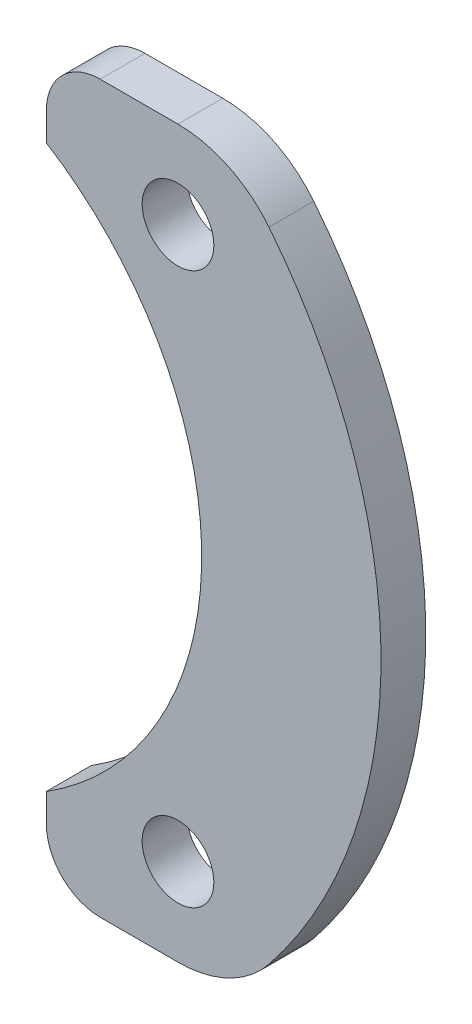
ISO-10303-21;
HEADER;
FILE_DESCRIPTION(('STEP AP214'),'2;1');
FILE_NAME('part.step','',(''),(''),'','','');
FILE_SCHEMA(('AUTOMOTIVE_DESIGN { 1 0 10303 214 1 1 1 1 }'));
ENDSEC;
DATA;
#1=APPLICATION_CONTEXT('core data for automotive mechanical design processes');
#2=APPLICATION_PROTOCOL_DEFINITION('international standard','automotive_design',2000,#1);
#3=PRODUCT_CONTEXT('',#1,'mechanical');
#4=PRODUCT('Part','Part','',(#3));
#5=PRODUCT_RELATED_PRODUCT_CATEGORY('part','',(#4));
#6=PRODUCT_DEFINITION_FORMATION('','',#4);
#7=PRODUCT_DEFINITION_CONTEXT('part definition',#1,'design');
#8=PRODUCT_DEFINITION('design','',#6,#7);
#9=PRODUCT_DEFINITION_SHAPE('','',#8);
#10=(LENGTH_UNIT() NAMED_UNIT(*) SI_UNIT(.MILLI.,.METRE.));
#11=(NAMED_UNIT(*) PLANE_ANGLE_UNIT() SI_UNIT($,.RADIAN.));
#12=(NAMED_UNIT(*) SI_UNIT($,.STERADIAN.) SOLID_ANGLE_UNIT());
#13=UNCERTAINTY_MEASURE_WITH_UNIT(LENGTH_MEASURE(1.E-05),#10,'distance_accuracy_value','');
#14=(GEOMETRIC_REPRESENTATION_CONTEXT(3) GLOBAL_UNCERTAINTY_ASSIGNED_CONTEXT((#13)) GLOBAL_UNIT_ASSIGNED_CONTEXT((#10,
#11,#12)) REPRESENTATION_CONTEXT('',''));
#15=CARTESIAN_POINT('',(0.,0.,0.));
#16=DIRECTION('',(0.,0.,1.));
#17=DIRECTION('',(1.,0.,0.));
#18=AXIS2_PLACEMENT_3D('',#15,#16,#17);
#19=CARTESIAN_POINT('',(17.1778106322656,13.7500000000001,2.5));
#20=DIRECTION('',(0.,0.,1.));
#21=DIRECTION('',(1.,0.,0.));
#22=AXIS2_PLACEMENT_3D('',#19,#20,#21);
#23=PLANE('',#22);
#24=CARTESIAN_POINT('',(17.1778106322657,-15.3913592438737,2.5));
#25=DIRECTION('',(0.,0.,1.));
#26=DIRECTION('',(1.,0.,0.));
#27=AXIS2_PLACEMENT_3D('',#24,#25,#26);
#28=CIRCLE('',#27,1.99999999999998);
#29=CARTESIAN_POINT('',(19.1778106322656,-15.3913592438737,2.5));
#30=VERTEX_POINT('',#29);
#31=EDGE_CURVE('E154',#30,#30,#28,.T.);
#32=ORIENTED_EDGE('',*,*,#31,.F.);
#33=EDGE_LOOP('',(#32));
#34=FACE_BOUND('',#33,.T.);
#35=CARTESIAN_POINT('',(17.1778106322656,13.7500000000001,2.5));
#36=DIRECTION('',(0.,0.,1.));
#37=DIRECTION('',(1.,0.,0.));
#38=AXIS2_PLACEMENT_3D('',#35,#36,#37);
#39=CIRCLE('',#38,6.5);
#40=CARTESIAN_POINT('',(22.2523406851082,17.8119139260697,2.5));
#41=VERTEX_POINT('',#40);
#42=CARTESIAN_POINT('',(17.1778106322656,20.2500000000001,2.5));
#43=VERTEX_POINT('',#42);
#44=EDGE_CURVE('E169',#41,#43,#39,.T.);
#45=ORIENTED_EDGE('',*,*,#44,.T.);
#46=DIRECTION('',(-1.,0.,0.));
#47=VECTOR('',#46,1.);
#48=CARTESIAN_POINT('',(17.1778106322656,20.2500000000001,2.5));
#49=LINE('',#48,#47);
#50=CARTESIAN_POINT('',(12.8330627677105,20.2500000000001,2.5));
#51=VERTEX_POINT('',#50);
#52=EDGE_CURVE('E107',#43,#51,#49,.T.);
#53=ORIENTED_EDGE('',*,*,#52,.T.);
#54=CARTESIAN_POINT('',(12.8330627677105,17.2500000000001,2.5));
#55=DIRECTION('',(0.,0.,1.));
#56=DIRECTION('',(1.,0.,0.));
#57=AXIS2_PLACEMENT_3D('',#54,#55,#56);
#58=CIRCLE('',#57,3.);
#59=CARTESIAN_POINT('',(9.83306276771046,17.2500000000001,2.5));
#60=VERTEX_POINT('',#59);
#61=EDGE_CURVE('E190',#51,#60,#58,.T.);
#62=ORIENTED_EDGE('',*,*,#61,.T.);
#63=DIRECTION('',(0.,-1.,0.));
#64=VECTOR('',#63,1.);
#65=CARTESIAN_POINT('',(9.83306276771046,17.2500000000001,2.5));
#66=LINE('',#65,#64);
#67=CARTESIAN_POINT('',(9.83306276771046,15.6703821461465,2.5));
#68=VERTEX_POINT('',#67);
#69=EDGE_CURVE('E209',#60,#68,#66,.T.);
#70=ORIENTED_EDGE('',*,*,#69,.T.);
#71=CARTESIAN_POINT('',(0.,0.,2.5));
#72=DIRECTION('',(0.,0.,-1.));
#73=DIRECTION('',(1.,0.,0.));
#74=AXIS2_PLACEMENT_3D('',#71,#72,#73);
#75=CIRCLE('',#74,18.5);
#76=CARTESIAN_POINT('',(9.83306276771046,-15.6703821461465,2.5));
#77=VERTEX_POINT('',#76);
#78=EDGE_CURVE('E206',#68,#77,#75,.T.);
#79=ORIENTED_EDGE('',*,*,#78,.T.);
#80=DIRECTION('',(0.,-1.,0.));
#81=VECTOR('',#80,1.);
#82=CARTESIAN_POINT('',(9.83306276771046,-15.6703821461465,2.5));
#83=LINE('',#82,#81);
#84=CARTESIAN_POINT('',(9.83306276771046,-17.2500000000001,2.5));
#85=VERTEX_POINT('',#84);
#86=EDGE_CURVE('E208',#77,#85,#83,.T.);
#87=ORIENTED_EDGE('',*,*,#86,.T.);
#88=CARTESIAN_POINT('',(12.8330627677105,-17.2500000000001,2.5));
#89=DIRECTION('',(0.,0.,1.));
#90=DIRECTION('',(1.,0.,0.));
#91=AXIS2_PLACEMENT_3D('',#88,#89,#90);
#92=CIRCLE('',#91,3.);
#93=CARTESIAN_POINT('',(12.8330627677105,-20.2500000000001,2.5));
#94=VERTEX_POINT('',#93);
#95=EDGE_CURVE('E132',#85,#94,#92,.T.);
#96=ORIENTED_EDGE('',*,*,#95,.T.);
#97=DIRECTION('',(1.,0.,0.));
#98=VECTOR('',#97,1.);
#99=CARTESIAN_POINT('',(12.8330627677105,-20.2500000000001,2.5));
#100=LINE('',#99,#98);
#101=CARTESIAN_POINT('',(17.1778106322656,-20.2500000000001,2.5));
#102=VERTEX_POINT('',#101);
#103=EDGE_CURVE('E126',#94,#102,#100,.T.);
#104=ORIENTED_EDGE('',*,*,#103,.T.);
#105=CARTESIAN_POINT('',(17.1778106322656,-13.7500000000001,2.5));
#106=DIRECTION('',(0.,0.,1.));
#107=DIRECTION('',(1.,0.,0.));
#108=AXIS2_PLACEMENT_3D('',#105,#106,#107);
#109=CIRCLE('',#108,6.5);
#110=CARTESIAN_POINT('',(22.2523406851082,-17.8119139260697,2.5));
#111=VERTEX_POINT('',#110);
#112=EDGE_CURVE('E130',#102,#111,#109,.T.);
#113=ORIENTED_EDGE('',*,*,#112,.T.);
#114=CARTESIAN_POINT('',(0.,0.,2.5));
#115=DIRECTION('',(0.,0.,1.));
#116=DIRECTION('',(1.,0.,0.));
#117=AXIS2_PLACEMENT_3D('',#114,#115,#116);
#118=CIRCLE('',#117,28.5031742736811);
#119=EDGE_CURVE('E58',#111,#41,#118,.T.);
#120=ORIENTED_EDGE('',*,*,#119,.T.);
#121=EDGE_LOOP('',(#45,#53,#62,#70,#79,#87,#96,#104,#113,#120));
#122=FACE_BOUND('',#121,.T.);
#123=CARTESIAN_POINT('',(17.1778106322656,15.3913592438737,2.5));
#124=DIRECTION('',(0.,0.,1.));
#125=DIRECTION('',(1.,0.,0.));
#126=AXIS2_PLACEMENT_3D('',#123,#124,#125);
#127=CIRCLE('',#126,2.00000000000001);
#128=CARTESIAN_POINT('',(19.1778106322656,15.3913592438737,2.5));
#129=VERTEX_POINT('',#128);
#130=EDGE_CURVE('E220',#129,#129,#127,.T.);
#131=ORIENTED_EDGE('',*,*,#130,.F.);
#132=EDGE_LOOP('',(#131));
#133=FACE_BOUND('',#132,.T.);
#134=ADVANCED_FACE('F41',(#34,#122,#133),#23,.T.);
#135=CARTESIAN_POINT('',(17.1778106322656,13.7500000000001,0.));
#136=DIRECTION('',(0.,0.,1.));
#137=DIRECTION('',(1.,0.,0.));
#138=AXIS2_PLACEMENT_3D('',#135,#136,#137);
#139=PLANE('',#138);
#140=CARTESIAN_POINT('',(17.1778106322656,13.7500000000001,0.));
#141=DIRECTION('',(0.,0.,1.));
#142=DIRECTION('',(1.,0.,0.));
#143=AXIS2_PLACEMENT_3D('',#140,#141,#142);
#144=CIRCLE('',#143,6.5);
#145=CARTESIAN_POINT('',(22.2523406851082,17.8119139260697,0.));
#146=VERTEX_POINT('',#145);
#147=CARTESIAN_POINT('',(17.1778106322656,20.2500000000001,0.));
#148=VERTEX_POINT('',#147);
#149=EDGE_CURVE('E150',#146,#148,#144,.T.);
#150=ORIENTED_EDGE('',*,*,#149,.F.);
#151=CARTESIAN_POINT('',(0.,0.,0.));
#152=DIRECTION('',(0.,0.,1.));
#153=DIRECTION('',(1.,0.,0.));
#154=AXIS2_PLACEMENT_3D('',#151,#152,#153);
#155=CIRCLE('',#154,28.5031742736811);
#156=CARTESIAN_POINT('',(22.2523406851082,-17.8119139260697,0.));
#157=VERTEX_POINT('',#156);
#158=EDGE_CURVE('E99',#157,#146,#155,.T.);
#159=ORIENTED_EDGE('',*,*,#158,.F.);
#160=CARTESIAN_POINT('',(17.1778106322656,-13.7500000000001,0.));
#161=DIRECTION('',(0.,0.,1.));
#162=DIRECTION('',(1.,0.,0.));
#163=AXIS2_PLACEMENT_3D('',#160,#161,#162);
#164=CIRCLE('',#163,6.5);
#165=CARTESIAN_POINT('',(17.1778106322656,-20.2500000000001,0.));
#166=VERTEX_POINT('',#165);
#167=EDGE_CURVE('E93',#166,#157,#164,.T.);
#168=ORIENTED_EDGE('',*,*,#167,.F.);
#169=DIRECTION('',(1.,0.,0.));
#170=VECTOR('',#169,1.);
#171=CARTESIAN_POINT('',(12.8330627677105,-20.2500000000001,0.));
#172=LINE('',#171,#170);
#173=CARTESIAN_POINT('',(12.8330627677105,-20.2500000000001,0.));
#174=VERTEX_POINT('',#173);
#175=EDGE_CURVE('E140',#174,#166,#172,.T.);
#176=ORIENTED_EDGE('',*,*,#175,.F.);
#177=CARTESIAN_POINT('',(12.8330627677105,-17.2500000000001,0.));
#178=DIRECTION('',(0.,0.,1.));
#179=DIRECTION('',(1.,0.,0.));
#180=AXIS2_PLACEMENT_3D('',#177,#178,#179);
#181=CIRCLE('',#180,3.);
#182=CARTESIAN_POINT('',(9.83306276771046,-17.2500000000001,0.));
#183=VERTEX_POINT('',#182);
#184=EDGE_CURVE('E164',#183,#174,#181,.T.);
#185=ORIENTED_EDGE('',*,*,#184,.F.);
#186=DIRECTION('',(0.,-1.,0.));
#187=VECTOR('',#186,1.);
#188=CARTESIAN_POINT('',(9.83306276771046,-15.6703821461465,0.));
#189=LINE('',#188,#187);
#190=CARTESIAN_POINT('',(9.83306276771046,-15.6703821461465,0.));
#191=VERTEX_POINT('',#190);
#192=EDGE_CURVE('E162',#191,#183,#189,.T.);
#193=ORIENTED_EDGE('',*,*,#192,.F.);
#194=CARTESIAN_POINT('',(0.,0.,0.));
#195=DIRECTION('',(0.,0.,-1.));
#196=DIRECTION('',(1.,0.,0.));
#197=AXIS2_PLACEMENT_3D('',#194,#195,#196);
#198=CIRCLE('',#197,18.5);
#199=CARTESIAN_POINT('',(9.83306276771046,15.6703821461465,0.));
#200=VERTEX_POINT('',#199);
#201=EDGE_CURVE('E160',#200,#191,#198,.T.);
#202=ORIENTED_EDGE('',*,*,#201,.F.);
#203=DIRECTION('',(0.,-1.,0.));
#204=VECTOR('',#203,1.);
#205=CARTESIAN_POINT('',(9.83306276771046,17.2500000000001,0.));
#206=LINE('',#205,#204);
#207=CARTESIAN_POINT('',(9.83306276771046,17.2500000000001,0.));
#208=VERTEX_POINT('',#207);
#209=EDGE_CURVE('E158',#208,#200,#206,.T.);
#210=ORIENTED_EDGE('',*,*,#209,.F.);
#211=CARTESIAN_POINT('',(12.8330627677105,17.2500000000001,0.));
#212=DIRECTION('',(0.,0.,1.));
#213=DIRECTION('',(1.,0.,0.));
#214=AXIS2_PLACEMENT_3D('',#211,#212,#213);
#215=CIRCLE('',#214,3.);
#216=CARTESIAN_POINT('',(12.8330627677105,20.2500000000001,0.));
#217=VERTEX_POINT('',#216);
#218=EDGE_CURVE('E156',#217,#208,#215,.T.);
#219=ORIENTED_EDGE('',*,*,#218,.F.);
#220=DIRECTION('',(-1.,0.,0.));
#221=VECTOR('',#220,1.);
#222=CARTESIAN_POINT('',(17.1778106322656,20.2500000000001,0.));
#223=LINE('',#222,#221);
#224=EDGE_CURVE('E153',#148,#217,#223,.T.);
#225=ORIENTED_EDGE('',*,*,#224,.F.);
#226=EDGE_LOOP('',(#150,#159,#168,#176,#185,#193,#202,#210,#219,#225));
#227=FACE_BOUND('',#226,.T.);
#228=CARTESIAN_POINT('',(17.1778106322657,-15.3913592438737,0.));
#229=DIRECTION('',(0.,0.,1.));
#230=DIRECTION('',(1.,0.,0.));
#231=AXIS2_PLACEMENT_3D('',#228,#229,#230);
#232=CIRCLE('',#231,1.99999999999998);
#233=CARTESIAN_POINT('',(19.1778106322656,-15.3913592438737,0.));
#234=VERTEX_POINT('',#233);
#235=EDGE_CURVE('E217',#234,#234,#232,.T.);
#236=ORIENTED_EDGE('',*,*,#235,.T.);
#237=EDGE_LOOP('',(#236));
#238=FACE_BOUND('',#237,.T.);
#239=CARTESIAN_POINT('',(17.1778106322656,15.3913592438737,0.));
#240=DIRECTION('',(0.,0.,1.));
#241=DIRECTION('',(1.,0.,0.));
#242=AXIS2_PLACEMENT_3D('',#239,#240,#241);
#243=CIRCLE('',#242,2.00000000000001);
#244=CARTESIAN_POINT('',(19.1778106322656,15.3913592438737,0.));
#245=VERTEX_POINT('',#244);
#246=EDGE_CURVE('E223',#245,#245,#243,.T.);
#247=ORIENTED_EDGE('',*,*,#246,.T.);
#248=EDGE_LOOP('',(#247));
#249=FACE_BOUND('',#248,.T.);
#250=ADVANCED_FACE('F194',(#227,#238,#249),#139,.F.);
#251=CARTESIAN_POINT('',(17.1778106322656,13.7500000000001,2.5));
#252=DIRECTION('',(0.,0.,-1.));
#253=DIRECTION('',(-1.,0.,0.));
#254=AXIS2_PLACEMENT_3D('',#251,#252,#253);
#255=CYLINDRICAL_SURFACE('',#254,6.5);
#256=ORIENTED_EDGE('',*,*,#149,.T.);
#257=DIRECTION('',(0.,0.,-1.));
#258=VECTOR('',#257,1.);
#259=CARTESIAN_POINT('',(17.1778106322656,20.2500000000001,2.5));
#260=LINE('',#259,#258);
#261=EDGE_CURVE('E13',#43,#148,#260,.T.);
#262=ORIENTED_EDGE('',*,*,#261,.F.);
#263=ORIENTED_EDGE('',*,*,#44,.F.);
#264=DIRECTION('',(0.,0.,-1.));
#265=VECTOR('',#264,1.);
#266=CARTESIAN_POINT('',(22.2523406851082,17.8119139260697,2.5));
#267=LINE('',#266,#265);
#268=EDGE_CURVE('E146',#41,#146,#267,.T.);
#269=ORIENTED_EDGE('',*,*,#268,.T.);
#270=EDGE_LOOP('',(#256,#262,#263,#269));
#271=FACE_BOUND('',#270,.T.);
#272=ADVANCED_FACE('F43',(#271),#255,.T.);
#273=CARTESIAN_POINT('',(17.1778106322656,20.2500000000001,2.5));
#274=DIRECTION('',(0.,-1.,0.));
#275=DIRECTION('',(0.,0.,-1.));
#276=AXIS2_PLACEMENT_3D('',#273,#274,#275);
#277=PLANE('',#276);
#278=ORIENTED_EDGE('',*,*,#224,.T.);
#279=DIRECTION('',(0.,0.,-1.));
#280=VECTOR('',#279,1.);
#281=CARTESIAN_POINT('',(12.8330627677105,20.2500000000001,2.5));
#282=LINE('',#281,#280);
#283=EDGE_CURVE('E50',#51,#217,#282,.T.);
#284=ORIENTED_EDGE('',*,*,#283,.F.);
#285=ORIENTED_EDGE('',*,*,#52,.F.);
#286=ORIENTED_EDGE('',*,*,#261,.T.);
#287=EDGE_LOOP('',(#278,#284,#285,#286));
#288=FACE_BOUND('',#287,.T.);
#289=ADVANCED_FACE('F263',(#288),#277,.F.);
#290=CARTESIAN_POINT('',(12.8330627677105,17.2500000000001,2.5));
#291=DIRECTION('',(0.,0.,-1.));
#292=DIRECTION('',(-1.,0.,0.));
#293=AXIS2_PLACEMENT_3D('',#290,#291,#292);
#294=CYLINDRICAL_SURFACE('',#293,3.);
#295=ORIENTED_EDGE('',*,*,#218,.T.);
#296=DIRECTION('',(0.,0.,-1.));
#297=VECTOR('',#296,1.);
#298=CARTESIAN_POINT('',(9.83306276771046,17.2500000000001,2.5));
#299=LINE('',#298,#297);
#300=EDGE_CURVE('E182',#60,#208,#299,.T.);
#301=ORIENTED_EDGE('',*,*,#300,.F.);
#302=ORIENTED_EDGE('',*,*,#61,.F.);
#303=ORIENTED_EDGE('',*,*,#283,.T.);
#304=EDGE_LOOP('',(#295,#301,#302,#303));
#305=FACE_BOUND('',#304,.T.);
#306=ADVANCED_FACE('F188',(#305),#294,.T.);
#307=CARTESIAN_POINT('',(9.83306276771046,17.2500000000001,2.5));
#308=DIRECTION('',(1.,0.,0.));
#309=DIRECTION('',(0.,0.,-1.));
#310=AXIS2_PLACEMENT_3D('',#307,#308,#309);
#311=PLANE('',#310);
#312=ORIENTED_EDGE('',*,*,#209,.T.);
#313=DIRECTION('',(0.,0.,-1.));
#314=VECTOR('',#313,1.);
#315=CARTESIAN_POINT('',(9.83306276771046,15.6703821461465,2.5));
#316=LINE('',#315,#314);
#317=EDGE_CURVE('E179',#68,#200,#316,.T.);
#318=ORIENTED_EDGE('',*,*,#317,.F.);
#319=ORIENTED_EDGE('',*,*,#69,.F.);
#320=ORIENTED_EDGE('',*,*,#300,.T.);
#321=EDGE_LOOP('',(#312,#318,#319,#320));
#322=FACE_BOUND('',#321,.T.);
#323=ADVANCED_FACE('F200',(#322),#311,.F.);
#324=CARTESIAN_POINT('',(0.,0.,2.5));
#325=DIRECTION('',(0.,0.,-1.));
#326=DIRECTION('',(-1.,0.,0.));
#327=AXIS2_PLACEMENT_3D('',#324,#325,#326);
#328=CYLINDRICAL_SURFACE('',#327,18.5);
#329=ORIENTED_EDGE('',*,*,#201,.T.);
#330=DIRECTION('',(0.,0.,-1.));
#331=VECTOR('',#330,1.);
#332=CARTESIAN_POINT('',(9.83306276771046,-15.6703821461465,2.5));
#333=LINE('',#332,#331);
#334=EDGE_CURVE('E176',#77,#191,#333,.T.);
#335=ORIENTED_EDGE('',*,*,#334,.F.);
#336=ORIENTED_EDGE('',*,*,#78,.F.);
#337=ORIENTED_EDGE('',*,*,#317,.T.);
#338=EDGE_LOOP('',(#329,#335,#336,#337));
#339=FACE_BOUND('',#338,.T.);
#340=ADVANCED_FACE('F204',(#339),#328,.F.);
#341=CARTESIAN_POINT('',(9.83306276771046,-15.6703821461465,2.5));
#342=DIRECTION('',(1.,0.,0.));
#343=DIRECTION('',(0.,0.,-1.));
#344=AXIS2_PLACEMENT_3D('',#341,#342,#343);
#345=PLANE('',#344);
#346=ORIENTED_EDGE('',*,*,#192,.T.);
#347=DIRECTION('',(0.,0.,-1.));
#348=VECTOR('',#347,1.);
#349=CARTESIAN_POINT('',(9.83306276771046,-17.2500000000001,2.5));
#350=LINE('',#349,#348);
#351=EDGE_CURVE('E173',#85,#183,#350,.T.);
#352=ORIENTED_EDGE('',*,*,#351,.F.);
#353=ORIENTED_EDGE('',*,*,#86,.F.);
#354=ORIENTED_EDGE('',*,*,#334,.T.);
#355=EDGE_LOOP('',(#346,#352,#353,#354));
#356=FACE_BOUND('',#355,.T.);
#357=ADVANCED_FACE('F253',(#356),#345,.F.);
#358=CARTESIAN_POINT('',(12.8330627677105,-17.2500000000001,2.5));
#359=DIRECTION('',(0.,0.,-1.));
#360=DIRECTION('',(-1.,0.,0.));
#361=AXIS2_PLACEMENT_3D('',#358,#359,#360);
#362=CYLINDRICAL_SURFACE('',#361,3.);
#363=ORIENTED_EDGE('',*,*,#184,.T.);
#364=DIRECTION('',(0.,0.,-1.));
#365=VECTOR('',#364,1.);
#366=CARTESIAN_POINT('',(12.8330627677105,-20.2500000000001,2.5));
#367=LINE('',#366,#365);
#368=EDGE_CURVE('E141',#94,#174,#367,.T.);
#369=ORIENTED_EDGE('',*,*,#368,.F.);
#370=ORIENTED_EDGE('',*,*,#95,.F.);
#371=ORIENTED_EDGE('',*,*,#351,.T.);
#372=EDGE_LOOP('',(#363,#369,#370,#371));
#373=FACE_BOUND('',#372,.T.);
#374=ADVANCED_FACE('F250',(#373),#362,.T.);
#375=CARTESIAN_POINT('',(12.8330627677105,-20.2500000000001,2.5));
#376=DIRECTION('',(0.,1.,0.));
#377=DIRECTION('',(0.,0.,1.));
#378=AXIS2_PLACEMENT_3D('',#375,#376,#377);
#379=PLANE('',#378);
#380=ORIENTED_EDGE('',*,*,#175,.T.);
#381=DIRECTION('',(0.,0.,-1.));
#382=VECTOR('',#381,1.);
#383=CARTESIAN_POINT('',(17.1778106322656,-20.2500000000001,2.5));
#384=LINE('',#383,#382);
#385=EDGE_CURVE('E137',#102,#166,#384,.T.);
#386=ORIENTED_EDGE('',*,*,#385,.F.);
#387=ORIENTED_EDGE('',*,*,#103,.F.);
#388=ORIENTED_EDGE('',*,*,#368,.T.);
#389=EDGE_LOOP('',(#380,#386,#387,#388));
#390=FACE_BOUND('',#389,.T.);
#391=ADVANCED_FACE('F138',(#390),#379,.F.);
#392=CARTESIAN_POINT('',(17.1778106322656,-13.7500000000001,2.5));
#393=DIRECTION('',(0.,0.,-1.));
#394=DIRECTION('',(-1.,0.,0.));
#395=AXIS2_PLACEMENT_3D('',#392,#393,#394);
#396=CYLINDRICAL_SURFACE('',#395,6.5);
#397=ORIENTED_EDGE('',*,*,#167,.T.);
#398=DIRECTION('',(0.,0.,-1.));
#399=VECTOR('',#398,1.);
#400=CARTESIAN_POINT('',(22.2523406851082,-17.8119139260697,2.5));
#401=LINE('',#400,#399);
#402=EDGE_CURVE('E142',#111,#157,#401,.T.);
#403=ORIENTED_EDGE('',*,*,#402,.F.);
#404=ORIENTED_EDGE('',*,*,#112,.F.);
#405=ORIENTED_EDGE('',*,*,#385,.T.);
#406=EDGE_LOOP('',(#397,#403,#404,#405));
#407=FACE_BOUND('',#406,.T.);
#408=ADVANCED_FACE('F144',(#407),#396,.T.);
#409=CARTESIAN_POINT('',(0.,0.,2.5));
#410=DIRECTION('',(0.,0.,-1.));
#411=DIRECTION('',(-1.,0.,0.));
#412=AXIS2_PLACEMENT_3D('',#409,#410,#411);
#413=CYLINDRICAL_SURFACE('',#412,28.5031742736811);
#414=ORIENTED_EDGE('',*,*,#158,.T.);
#415=ORIENTED_EDGE('',*,*,#268,.F.);
#416=ORIENTED_EDGE('',*,*,#119,.F.);
#417=ORIENTED_EDGE('',*,*,#402,.T.);
#418=EDGE_LOOP('',(#414,#415,#416,#417));
#419=FACE_BOUND('',#418,.T.);
#420=ADVANCED_FACE('F243',(#419),#413,.T.);
#421=CARTESIAN_POINT('',(17.1778106322657,-15.3913592438737,2.5));
#422=DIRECTION('',(0.,0.,-1.));
#423=DIRECTION('',(-1.,0.,0.));
#424=AXIS2_PLACEMENT_3D('',#421,#422,#423);
#425=CYLINDRICAL_SURFACE('',#424,1.99999999999998);
#426=ORIENTED_EDGE('',*,*,#31,.T.);
#427=EDGE_LOOP('',(#426));
#428=FACE_BOUND('',#427,.T.);
#429=ORIENTED_EDGE('',*,*,#235,.F.);
#430=EDGE_LOOP('',(#429));
#431=FACE_BOUND('',#430,.T.);
#432=ADVANCED_FACE('F240',(#428,#431),#425,.F.);
#433=CARTESIAN_POINT('',(17.1778106322656,15.3913592438737,2.5));
#434=DIRECTION('',(0.,0.,-1.));
#435=DIRECTION('',(-1.,0.,0.));
#436=AXIS2_PLACEMENT_3D('',#433,#434,#435);
#437=CYLINDRICAL_SURFACE('',#436,2.00000000000001);
#438=ORIENTED_EDGE('',*,*,#130,.T.);
#439=EDGE_LOOP('',(#438));
#440=FACE_BOUND('',#439,.T.);
#441=ORIENTED_EDGE('',*,*,#246,.F.);
#442=EDGE_LOOP('',(#441));
#443=FACE_BOUND('',#442,.T.);
#444=ADVANCED_FACE('F229',(#440,#443),#437,.F.);
#445=CLOSED_SHELL('',(#134,#250,#272,#289,#306,#323,#340,#357,#374,#391,#408,#420,#432,#444));
#446=MANIFOLD_SOLID_BREP('B2',#445);
#447=ADVANCED_BREP_SHAPE_REPRESENTATION('',(#18,#446),#14);
#448=SHAPE_DEFINITION_REPRESENTATION(#9,#447);
ENDSEC;
END-ISO-10303-21;
